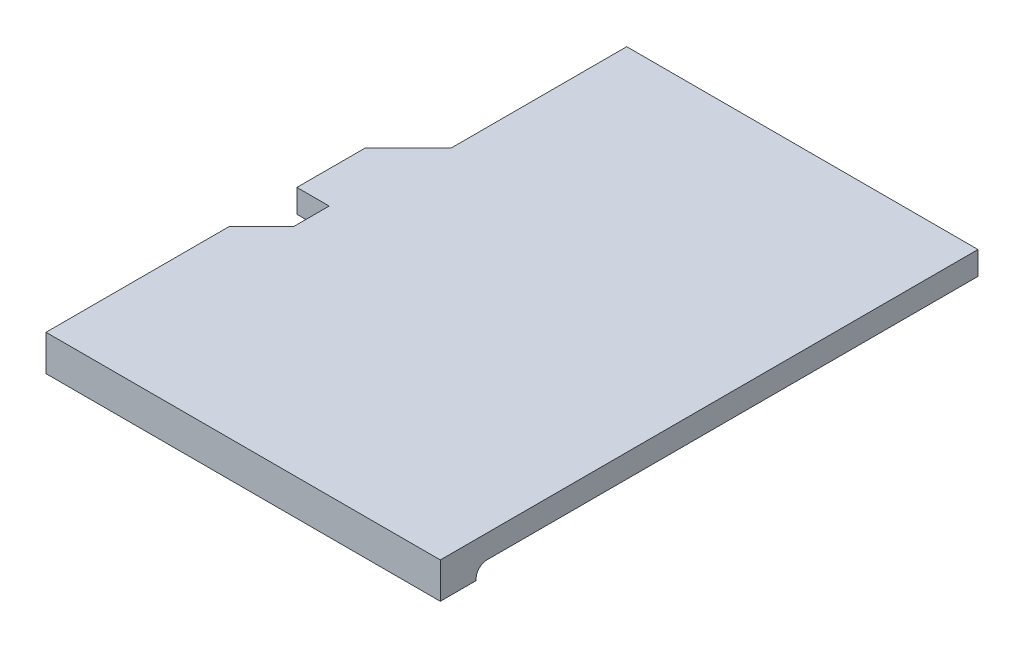
ISO-10303-21;
HEADER;
FILE_DESCRIPTION(('STEP AP214'),'2;1');
FILE_NAME('part.step','',(''),(''),'','','');
FILE_SCHEMA(('AUTOMOTIVE_DESIGN { 1 0 10303 214 1 1 1 1 }'));
ENDSEC;
DATA;
#1=APPLICATION_CONTEXT('core data for automotive mechanical design processes');
#2=APPLICATION_PROTOCOL_DEFINITION('international standard','automotive_design',2000,#1);
#3=PRODUCT_CONTEXT('',#1,'mechanical');
#4=PRODUCT('Part','Part','',(#3));
#5=PRODUCT_RELATED_PRODUCT_CATEGORY('part','',(#4));
#6=PRODUCT_DEFINITION_FORMATION('','',#4);
#7=PRODUCT_DEFINITION_CONTEXT('part definition',#1,'design');
#8=PRODUCT_DEFINITION('design','',#6,#7);
#9=PRODUCT_DEFINITION_SHAPE('','',#8);
#10=(LENGTH_UNIT() NAMED_UNIT(*) SI_UNIT(.MILLI.,.METRE.));
#11=(NAMED_UNIT(*) PLANE_ANGLE_UNIT() SI_UNIT($,.RADIAN.));
#12=(NAMED_UNIT(*) SI_UNIT($,.STERADIAN.) SOLID_ANGLE_UNIT());
#13=UNCERTAINTY_MEASURE_WITH_UNIT(LENGTH_MEASURE(1.E-05),#10,'distance_accuracy_value','');
#14=(GEOMETRIC_REPRESENTATION_CONTEXT(3) GLOBAL_UNCERTAINTY_ASSIGNED_CONTEXT((#13)) GLOBAL_UNIT_ASSIGNED_CONTEXT((#10,
#11,#12)) REPRESENTATION_CONTEXT('',''));
#15=CARTESIAN_POINT('',(0.,0.,0.));
#16=DIRECTION('',(0.,0.,1.));
#17=DIRECTION('',(1.,0.,0.));
#18=AXIS2_PLACEMENT_3D('',#15,#16,#17);
#19=CARTESIAN_POINT('',(0.,0.,36.5));
#20=DIRECTION('',(0.,-1.,0.));
#21=DIRECTION('',(0.,0.,-1.));
#22=AXIS2_PLACEMENT_3D('',#19,#20,#21);
#23=CYLINDRICAL_SURFACE('',#22,30.5);
#24=CARTESIAN_POINT('',(0.,-0.35,36.5));
#25=DIRECTION('',(0.,-1.,0.));
#26=DIRECTION('',(0.,0.,-1.));
#27=AXIS2_PLACEMENT_3D('',#24,#25,#26);
#28=CIRCLE('',#27,30.5);
#29=CARTESIAN_POINT('',(-5.5,-0.35,6.5));
#30=VERTEX_POINT('',#29);
#31=CARTESIAN_POINT('',(5.5,-0.35,6.5));
#32=VERTEX_POINT('',#31);
#33=EDGE_CURVE('E131',#30,#32,#28,.T.);
#34=ORIENTED_EDGE('',*,*,#33,.F.);
#35=DIRECTION('',(0.,-1.,0.));
#36=VECTOR('',#35,1.);
#37=CARTESIAN_POINT('',(-5.5,0.,6.5));
#38=LINE('',#37,#36);
#39=CARTESIAN_POINT('',(-5.5,-0.3,6.5));
#40=VERTEX_POINT('',#39);
#41=EDGE_CURVE('E120',#30,#40,#38,.F.);
#42=ORIENTED_EDGE('',*,*,#41,.T.);
#43=CARTESIAN_POINT('',(0.,-0.3,36.5));
#44=DIRECTION('',(0.,1.,0.));
#45=DIRECTION('',(0.,0.,1.));
#46=AXIS2_PLACEMENT_3D('',#43,#44,#45);
#47=CIRCLE('',#46,30.5);
#48=CARTESIAN_POINT('',(5.5,-0.3,6.5));
#49=VERTEX_POINT('',#48);
#50=EDGE_CURVE('E127',#40,#49,#47,.F.);
#51=ORIENTED_EDGE('',*,*,#50,.T.);
#52=DIRECTION('',(0.,-1.,0.));
#53=VECTOR('',#52,1.);
#54=CARTESIAN_POINT('',(5.5,0.,6.5));
#55=LINE('',#54,#53);
#56=EDGE_CURVE('E112',#49,#32,#55,.T.);
#57=ORIENTED_EDGE('',*,*,#56,.T.);
#58=EDGE_LOOP('',(#34,#42,#51,#57));
#59=FACE_BOUND('',#58,.T.);
#60=ADVANCED_FACE('F16',(#59),#23,.T.);
#61=CARTESIAN_POINT('',(0.,-0.3,36.5));
#62=DIRECTION('',(0.,1.,0.));
#63=DIRECTION('',(0.,0.,1.));
#64=AXIS2_PLACEMENT_3D('',#61,#62,#63);
#65=TOROIDAL_SURFACE('',#64,30.8,0.3);
#66=ORIENTED_EDGE('',*,*,#50,.F.);
#67=CARTESIAN_POINT('',(-5.50000000000001,0.,6.19504990929699));
#68=CARTESIAN_POINT('',(-5.4999999999995,1.33591663660623E-05,6.21241243459702));
#69=CARTESIAN_POINT('',(-5.49999999999971,-0.0014584749207835,6.22977221391287));
#70=CARTESIAN_POINT('',(-5.50000000000029,-0.00727537093845433,6.26399834473381));
#71=CARTESIAN_POINT('',(-5.50000000000067,-0.0116195360169997,6.28086484854246));
#72=CARTESIAN_POINT('',(-5.50000000000038,-0.0230876845066284,6.3136383261426));
#73=CARTESIAN_POINT('',(-5.49999999999971,-0.0302134299476715,6.32954468432763));
#74=CARTESIAN_POINT('',(-5.50000000000029,-0.0470507940960762,6.3599190939301));
#75=CARTESIAN_POINT('',(-5.50000000000156,-0.0567616194024566,6.3743875847833));
#76=CARTESIAN_POINT('',(-5.50000000000162,-0.0784294057998209,6.40136040939991));
#77=CARTESIAN_POINT('',(-5.50000000000043,-0.0903696361954534,6.41387817559003));
#78=CARTESIAN_POINT('',(-5.49999999999957,-0.116211132024598,6.43669167210008));
#79=CARTESIAN_POINT('',(-5.49999999999989,-0.130112084961435,6.4469877558478));
#80=CARTESIAN_POINT('',(-5.50000000000011,-0.159253136893758,6.46489826908499));
#81=CARTESIAN_POINT('',(-5.50000000000003,-0.174469702927348,6.47255103554552));
#82=CARTESIAN_POINT('',(-5.49999999999997,-0.205980556919425,6.48514460204624));
#83=CARTESIAN_POINT('',(-5.49999999999999,-0.222273944317642,6.49008763690061));
#84=CARTESIAN_POINT('',(-5.5,-0.248909603235763,6.49572631466867));
#85=CARTESIAN_POINT('',(-5.5,-0.259068674145335,6.49732802223716));
#86=CARTESIAN_POINT('',(-5.5,-0.279483578737172,6.49946458489195));
#87=CARTESIAN_POINT('',(-5.5,-0.289739252276583,6.50000097072089));
#88=CARTESIAN_POINT('',(-5.5,-0.299999999999996,6.49999999999999));
#89=B_SPLINE_CURVE_WITH_KNOTS('',3,(#67,#68,#69,#70,#71,#72,#73,#74,#75,#76,#77,#78,#79,#80,#81,
#82,#83,#84,#85,#86,#87,#88),.UNSPECIFIED.,.F.,.F.,(4,2,2,2,2,2,2,2,2,2,4),(0.,
0.0520216922137032,0.104027148924245,0.156065602799885,0.208088103646524,0.259734841042164,
0.311373356348775,0.362227955165807,0.413040549003677,0.443843165959415,0.474601491046942),.UNSPECIFIED.);
#90=CARTESIAN_POINT('',(-5.49999999999999,0.,6.19504990929699));
#91=VERTEX_POINT('',#90);
#92=EDGE_CURVE('E117',#91,#40,#89,.T.);
#93=ORIENTED_EDGE('',*,*,#92,.F.);
#94=CARTESIAN_POINT('',(0.,0.,36.5));
#95=DIRECTION('',(0.,-1.,0.));
#96=DIRECTION('',(-0.178571428571428,0.,-0.983926950996851));
#97=AXIS2_PLACEMENT_3D('',#94,#95,#96);
#98=CIRCLE('',#97,30.8);
#99=CARTESIAN_POINT('',(5.5,0.,6.19504990929699));
#100=VERTEX_POINT('',#99);
#101=EDGE_CURVE('E144',#91,#100,#98,.T.);
#102=ORIENTED_EDGE('',*,*,#101,.T.);
#103=CARTESIAN_POINT('',(5.50000000000001,-0.3,6.49999999999999));
#104=CARTESIAN_POINT('',(5.49999999999996,-0.283322027292299,6.50001549346963));
#105=CARTESIAN_POINT('',(5.49999999999998,-0.266649991355988,6.49858702026892));
#106=CARTESIAN_POINT('',(5.50000000000002,-0.233801123224783,6.49295845943377));
#107=CARTESIAN_POINT('',(5.50000000000004,-0.217623696857119,6.48876184600417));
#108=CARTESIAN_POINT('',(5.49999999999995,-0.186198271619582,6.47771103302166));
#109=CARTESIAN_POINT('',(5.49999999999985,-0.170950570559622,6.4708559870403));
#110=CARTESIAN_POINT('',(5.50000000000015,-0.141812070083496,6.45470279694147));
#111=CARTESIAN_POINT('',(5.50000000000056,-0.127921211183974,6.44540475998963));
#112=CARTESIAN_POINT('',(5.50000000000052,-0.10177481322185,6.42456445317543));
#113=CARTESIAN_POINT('',(5.50000000000006,-0.0895318508629306,6.41300641226746));
#114=CARTESIAN_POINT('',(5.49999999999994,-0.0671233254217876,6.38802611476666));
#115=CARTESIAN_POINT('',(5.50000000000026,-0.0569579996828737,6.37460364548067));
#116=CARTESIAN_POINT('',(5.50000000000032,-0.0388245508854178,6.34605271408475));
#117=CARTESIAN_POINT('',(5.50000000000005,-0.0308934194654258,6.33090078154519));
#118=CARTESIAN_POINT('',(5.49999999999995,-0.0176486358557576,6.29949574661209));
#119=CARTESIAN_POINT('',(5.50000000000013,-0.0123340403630538,6.28324304347133));
#120=CARTESIAN_POINT('',(5.50000000000014,-0.00560463269504238,6.25494252531882));
#121=CARTESIAN_POINT('',(5.50000000000006,-0.00350419527526133,6.24305286728713));
#122=CARTESIAN_POINT('',(5.49999999999994,-0.000701922432728202,6.21912686292336));
#123=CARTESIAN_POINT('',(5.4999999999999,1.87853952070261E-06,6.20709074676156));
#124=CARTESIAN_POINT('',(5.49999999999999,0.,6.195049909297));
#125=B_SPLINE_CURVE_WITH_KNOTS('',3,(#103,#104,#105,#106,#107,#108,#109,#110,#111,#112,#113,
#114,#115,#116,#117,#118,#119,#120,#121,#122,#123,#124),.UNSPECIFIED.,.F.,.F.,(4,2,2,2,2,2,2,2,
2,2,4),(0.,0.0499640333725207,0.0998654774881927,0.149782822976273,0.199697979127064,
0.24997476188535,0.300257284914306,0.351329041840026,0.40238237307373,0.438526066866833,
0.474618857831877),.UNSPECIFIED.);
#126=EDGE_CURVE('E135',#49,#100,#125,.T.);
#127=ORIENTED_EDGE('',*,*,#126,.F.);
#128=EDGE_LOOP('',(#66,#93,#102,#127));
#129=FACE_BOUND('',#128,.T.);
#130=ADVANCED_FACE('F134',(#129),#65,.F.);
#131=CARTESIAN_POINT('',(0.,-0.35,6.93372741582503));
#132=DIRECTION('',(0.,-1.,0.));
#133=DIRECTION('',(0.,0.,-1.));
#134=AXIS2_PLACEMENT_3D('',#131,#132,#133);
#135=PLANE('',#134);
#136=DIRECTION('',(0.,0.,-1.));
#137=VECTOR('',#136,1.);
#138=CARTESIAN_POINT('',(5.5,-0.35,6.93372741582503));
#139=LINE('',#138,#137);
#140=CARTESIAN_POINT('',(5.5,-0.35,7.5));
#141=VERTEX_POINT('',#140);
#142=EDGE_CURVE('E270',#32,#141,#139,.F.);
#143=ORIENTED_EDGE('',*,*,#142,.T.);
#144=DIRECTION('',(1.,0.,0.));
#145=VECTOR('',#144,1.);
#146=CARTESIAN_POINT('',(-5.5,-0.35,7.5));
#147=LINE('',#146,#145);
#148=CARTESIAN_POINT('',(-5.5,-0.35,7.5));
#149=VERTEX_POINT('',#148);
#150=EDGE_CURVE('E149',#149,#141,#147,.T.);
#151=ORIENTED_EDGE('',*,*,#150,.F.);
#152=DIRECTION('',(0.,0.,-1.));
#153=VECTOR('',#152,1.);
#154=CARTESIAN_POINT('',(-5.5,-0.35,6.93372741582503));
#155=LINE('',#154,#153);
#156=EDGE_CURVE('E137',#149,#30,#155,.T.);
#157=ORIENTED_EDGE('',*,*,#156,.T.);
#158=ORIENTED_EDGE('',*,*,#33,.T.);
#159=EDGE_LOOP('',(#143,#151,#157,#158));
#160=FACE_BOUND('',#159,.T.);
#161=ADVANCED_FACE('F159',(#160),#135,.T.);
#162=CARTESIAN_POINT('',(0.0936244587815548,0.,0.17467868973583));
#163=DIRECTION('',(0.,1.,0.));
#164=DIRECTION('',(0.,0.,1.));
#165=AXIS2_PLACEMENT_3D('',#162,#163,#164);
#166=PLANE('',#165);
#167=DIRECTION('',(0.,0.,1.));
#168=VECTOR('',#167,1.);
#169=CARTESIAN_POINT('',(-5.5,0.,2.4));
#170=LINE('',#169,#168);
#171=CARTESIAN_POINT('',(-5.5,0.,2.4));
#172=VERTEX_POINT('',#171);
#173=EDGE_CURVE('E122',#172,#91,#170,.T.);
#174=ORIENTED_EDGE('',*,*,#173,.F.);
#175=DIRECTION('',(-0.707106781186547,0.,0.707106781186548));
#176=VECTOR('',#175,1.);
#177=CARTESIAN_POINT('',(-4.6,0.,1.5));
#178=LINE('',#177,#176);
#179=CARTESIAN_POINT('',(-4.6,0.,1.5));
#180=VERTEX_POINT('',#179);
#181=EDGE_CURVE('E190',#180,#172,#178,.T.);
#182=ORIENTED_EDGE('',*,*,#181,.F.);
#183=DIRECTION('',(0.,0.,1.));
#184=VECTOR('',#183,1.);
#185=CARTESIAN_POINT('',(-4.6,0.,0.5));
#186=LINE('',#185,#184);
#187=CARTESIAN_POINT('',(-4.6,0.,0.499999999999999));
#188=VERTEX_POINT('',#187);
#189=EDGE_CURVE('E206',#188,#180,#186,.T.);
#190=ORIENTED_EDGE('',*,*,#189,.F.);
#191=DIRECTION('',(1.,0.,0.));
#192=VECTOR('',#191,1.);
#193=CARTESIAN_POINT('',(-5.5,0.,0.5));
#194=LINE('',#193,#192);
#195=CARTESIAN_POINT('',(-5.5,0.,0.5));
#196=VERTEX_POINT('',#195);
#197=EDGE_CURVE('E216',#196,#188,#194,.T.);
#198=ORIENTED_EDGE('',*,*,#197,.F.);
#199=DIRECTION('',(0.,0.,1.));
#200=VECTOR('',#199,1.);
#201=CARTESIAN_POINT('',(-5.5,0.,-1.4));
#202=LINE('',#201,#200);
#203=CARTESIAN_POINT('',(-5.5,0.,-1.4));
#204=VERTEX_POINT('',#203);
#205=EDGE_CURVE('E226',#204,#196,#202,.T.);
#206=ORIENTED_EDGE('',*,*,#205,.F.);
#207=DIRECTION('',(-0.707106781186548,0.,0.707106781186547));
#208=VECTOR('',#207,1.);
#209=CARTESIAN_POINT('',(-4.3,0.,-2.6));
#210=LINE('',#209,#208);
#211=CARTESIAN_POINT('',(-4.3,0.,-2.6));
#212=VERTEX_POINT('',#211);
#213=EDGE_CURVE('E236',#212,#204,#210,.T.);
#214=ORIENTED_EDGE('',*,*,#213,.F.);
#215=DIRECTION('',(0.,0.,1.));
#216=VECTOR('',#215,1.);
#217=CARTESIAN_POINT('',(-4.3,0.,-7.5));
#218=LINE('',#217,#216);
#219=CARTESIAN_POINT('',(-4.3,0.,-7.5));
#220=VERTEX_POINT('',#219);
#221=EDGE_CURVE('E246',#220,#212,#218,.T.);
#222=ORIENTED_EDGE('',*,*,#221,.F.);
#223=DIRECTION('',(-1.,0.,0.));
#224=VECTOR('',#223,1.);
#225=CARTESIAN_POINT('',(5.5,0.,-7.5));
#226=LINE('',#225,#224);
#227=CARTESIAN_POINT('',(5.5,0.,-7.5));
#228=VERTEX_POINT('',#227);
#229=EDGE_CURVE('E256',#228,#220,#226,.T.);
#230=ORIENTED_EDGE('',*,*,#229,.F.);
#231=DIRECTION('',(0.,0.,-1.));
#232=VECTOR('',#231,1.);
#233=CARTESIAN_POINT('',(5.5,0.,7.5));
#234=LINE('',#233,#232);
#235=EDGE_CURVE('E286',#100,#228,#234,.T.);
#236=ORIENTED_EDGE('',*,*,#235,.F.);
#237=ORIENTED_EDGE('',*,*,#101,.F.);
#238=EDGE_LOOP('',(#174,#182,#190,#198,#206,#214,#222,#230,#236,#237));
#239=FACE_BOUND('',#238,.T.);
#240=ADVANCED_FACE('F179',(#239),#166,.F.);
#241=CARTESIAN_POINT('',(-5.5,0.,7.5));
#242=DIRECTION('',(0.,0.,1.));
#243=DIRECTION('',(1.,0.,0.));
#244=AXIS2_PLACEMENT_3D('',#241,#242,#243);
#245=PLANE('',#244);
#246=DIRECTION('',(0.,1.,0.));
#247=VECTOR('',#246,1.);
#248=CARTESIAN_POINT('',(-5.5,0.,7.5));
#249=LINE('',#248,#247);
#250=CARTESIAN_POINT('',(-5.5,0.65,7.5));
#251=VERTEX_POINT('',#250);
#252=EDGE_CURVE('E203',#149,#251,#249,.T.);
#253=ORIENTED_EDGE('',*,*,#252,.F.);
#254=ORIENTED_EDGE('',*,*,#150,.T.);
#255=DIRECTION('',(0.,1.,0.));
#256=VECTOR('',#255,1.);
#257=CARTESIAN_POINT('',(5.5,0.,7.5));
#258=LINE('',#257,#256);
#259=CARTESIAN_POINT('',(5.5,0.65,7.5));
#260=VERTEX_POINT('',#259);
#261=EDGE_CURVE('E259',#260,#141,#258,.F.);
#262=ORIENTED_EDGE('',*,*,#261,.F.);
#263=DIRECTION('',(1.,0.,0.));
#264=VECTOR('',#263,1.);
#265=CARTESIAN_POINT('',(0.0936244587815549,0.65,7.5));
#266=LINE('',#265,#264);
#267=EDGE_CURVE('E202',#251,#260,#266,.T.);
#268=ORIENTED_EDGE('',*,*,#267,.F.);
#269=EDGE_LOOP('',(#253,#254,#262,#268));
#270=FACE_BOUND('',#269,.T.);
#271=ADVANCED_FACE('F176',(#270),#245,.T.);
#272=CARTESIAN_POINT('',(5.5,0.,7.5));
#273=DIRECTION('',(1.,0.,0.));
#274=DIRECTION('',(0.,0.,-1.));
#275=AXIS2_PLACEMENT_3D('',#272,#273,#274);
#276=PLANE('',#275);
#277=ORIENTED_EDGE('',*,*,#56,.F.);
#278=ORIENTED_EDGE('',*,*,#126,.T.);
#279=ORIENTED_EDGE('',*,*,#235,.T.);
#280=DIRECTION('',(0.,1.,0.));
#281=VECTOR('',#280,1.);
#282=CARTESIAN_POINT('',(5.5,0.,-7.5));
#283=LINE('',#282,#281);
#284=CARTESIAN_POINT('',(5.5,0.65,-7.5));
#285=VERTEX_POINT('',#284);
#286=EDGE_CURVE('E249',#285,#228,#283,.F.);
#287=ORIENTED_EDGE('',*,*,#286,.F.);
#288=DIRECTION('',(0.,0.,1.));
#289=VECTOR('',#288,1.);
#290=CARTESIAN_POINT('',(5.5,0.65,0.17467868973583));
#291=LINE('',#290,#289);
#292=EDGE_CURVE('E299',#260,#285,#291,.F.);
#293=ORIENTED_EDGE('',*,*,#292,.F.);
#294=ORIENTED_EDGE('',*,*,#261,.T.);
#295=ORIENTED_EDGE('',*,*,#142,.F.);
#296=EDGE_LOOP('',(#277,#278,#279,#287,#293,#294,#295));
#297=FACE_BOUND('',#296,.T.);
#298=ADVANCED_FACE('F170',(#297),#276,.T.);
#299=CARTESIAN_POINT('',(5.5,0.,-7.5));
#300=DIRECTION('',(0.,0.,-1.));
#301=DIRECTION('',(-1.,0.,0.));
#302=AXIS2_PLACEMENT_3D('',#299,#300,#301);
#303=PLANE('',#302);
#304=DIRECTION('',(1.,0.,0.));
#305=VECTOR('',#304,1.);
#306=CARTESIAN_POINT('',(0.0936244587815549,0.65,-7.5));
#307=LINE('',#306,#305);
#308=CARTESIAN_POINT('',(-4.3,0.65,-7.5));
#309=VERTEX_POINT('',#308);
#310=EDGE_CURVE('E302',#285,#309,#307,.F.);
#311=ORIENTED_EDGE('',*,*,#310,.F.);
#312=ORIENTED_EDGE('',*,*,#286,.T.);
#313=ORIENTED_EDGE('',*,*,#229,.T.);
#314=DIRECTION('',(0.,1.,0.));
#315=VECTOR('',#314,1.);
#316=CARTESIAN_POINT('',(-4.3,0.,-7.5));
#317=LINE('',#316,#315);
#318=EDGE_CURVE('E239',#309,#220,#317,.F.);
#319=ORIENTED_EDGE('',*,*,#318,.F.);
#320=EDGE_LOOP('',(#311,#312,#313,#319));
#321=FACE_BOUND('',#320,.T.);
#322=ADVANCED_FACE('F175',(#321),#303,.T.);
#323=CARTESIAN_POINT('',(-4.3,0.,-7.5));
#324=DIRECTION('',(-1.,0.,0.));
#325=DIRECTION('',(0.,0.,1.));
#326=AXIS2_PLACEMENT_3D('',#323,#324,#325);
#327=PLANE('',#326);
#328=DIRECTION('',(0.,0.,1.));
#329=VECTOR('',#328,1.);
#330=CARTESIAN_POINT('',(-4.3,0.65,0.17467868973583));
#331=LINE('',#330,#329);
#332=CARTESIAN_POINT('',(-4.3,0.65,-2.6));
#333=VERTEX_POINT('',#332);
#334=EDGE_CURVE('E305',#309,#333,#331,.T.);
#335=ORIENTED_EDGE('',*,*,#334,.F.);
#336=ORIENTED_EDGE('',*,*,#318,.T.);
#337=ORIENTED_EDGE('',*,*,#221,.T.);
#338=DIRECTION('',(0.,1.,0.));
#339=VECTOR('',#338,1.);
#340=CARTESIAN_POINT('',(-4.3,0.,-2.6));
#341=LINE('',#340,#339);
#342=EDGE_CURVE('E229',#333,#212,#341,.F.);
#343=ORIENTED_EDGE('',*,*,#342,.F.);
#344=EDGE_LOOP('',(#335,#336,#337,#343));
#345=FACE_BOUND('',#344,.T.);
#346=ADVANCED_FACE('F338',(#345),#327,.T.);
#347=CARTESIAN_POINT('',(-4.3,0.,-2.6));
#348=DIRECTION('',(-0.707106781186547,0.,-0.707106781186548));
#349=DIRECTION('',(-0.707106781186548,0.,0.707106781186547));
#350=AXIS2_PLACEMENT_3D('',#347,#348,#349);
#351=PLANE('',#350);
#352=DIRECTION('',(-0.707106781186547,0.,0.707106781186548));
#353=VECTOR('',#352,1.);
#354=CARTESIAN_POINT('',(-4.3,0.65,-2.6));
#355=LINE('',#354,#353);
#356=CARTESIAN_POINT('',(-5.5,0.65,-1.4));
#357=VERTEX_POINT('',#356);
#358=EDGE_CURVE('E308',#333,#357,#355,.T.);
#359=ORIENTED_EDGE('',*,*,#358,.F.);
#360=ORIENTED_EDGE('',*,*,#342,.T.);
#361=ORIENTED_EDGE('',*,*,#213,.T.);
#362=DIRECTION('',(0.,1.,0.));
#363=VECTOR('',#362,1.);
#364=CARTESIAN_POINT('',(-5.5,0.,-1.4));
#365=LINE('',#364,#363);
#366=EDGE_CURVE('E219',#357,#204,#365,.F.);
#367=ORIENTED_EDGE('',*,*,#366,.F.);
#368=EDGE_LOOP('',(#359,#360,#361,#367));
#369=FACE_BOUND('',#368,.T.);
#370=ADVANCED_FACE('F335',(#369),#351,.T.);
#371=CARTESIAN_POINT('',(-5.5,0.,-1.4));
#372=DIRECTION('',(-1.,0.,0.));
#373=DIRECTION('',(0.,0.,1.));
#374=AXIS2_PLACEMENT_3D('',#371,#372,#373);
#375=PLANE('',#374);
#376=DIRECTION('',(0.,0.,1.));
#377=VECTOR('',#376,1.);
#378=CARTESIAN_POINT('',(-5.5,0.65,0.17467868973583));
#379=LINE('',#378,#377);
#380=CARTESIAN_POINT('',(-5.5,0.65,0.5));
#381=VERTEX_POINT('',#380);
#382=EDGE_CURVE('E311',#357,#381,#379,.T.);
#383=ORIENTED_EDGE('',*,*,#382,.F.);
#384=ORIENTED_EDGE('',*,*,#366,.T.);
#385=ORIENTED_EDGE('',*,*,#205,.T.);
#386=DIRECTION('',(0.,1.,0.));
#387=VECTOR('',#386,1.);
#388=CARTESIAN_POINT('',(-5.5,0.,0.5));
#389=LINE('',#388,#387);
#390=EDGE_CURVE('E209',#381,#196,#389,.F.);
#391=ORIENTED_EDGE('',*,*,#390,.F.);
#392=EDGE_LOOP('',(#383,#384,#385,#391));
#393=FACE_BOUND('',#392,.T.);
#394=ADVANCED_FACE('F332',(#393),#375,.T.);
#395=CARTESIAN_POINT('',(-5.5,0.,0.5));
#396=DIRECTION('',(0.,0.,1.));
#397=DIRECTION('',(1.,0.,0.));
#398=AXIS2_PLACEMENT_3D('',#395,#396,#397);
#399=PLANE('',#398);
#400=DIRECTION('',(1.,0.,0.));
#401=VECTOR('',#400,1.);
#402=CARTESIAN_POINT('',(0.0936244587815549,0.65,0.499999999999999));
#403=LINE('',#402,#401);
#404=CARTESIAN_POINT('',(-4.6,0.65,0.5));
#405=VERTEX_POINT('',#404);
#406=EDGE_CURVE('E314',#381,#405,#403,.T.);
#407=ORIENTED_EDGE('',*,*,#406,.F.);
#408=ORIENTED_EDGE('',*,*,#390,.T.);
#409=ORIENTED_EDGE('',*,*,#197,.T.);
#410=DIRECTION('',(0.,1.,0.));
#411=VECTOR('',#410,1.);
#412=CARTESIAN_POINT('',(-4.6,0.,0.499999999999999));
#413=LINE('',#412,#411);
#414=EDGE_CURVE('E198',#405,#188,#413,.F.);
#415=ORIENTED_EDGE('',*,*,#414,.F.);
#416=EDGE_LOOP('',(#407,#408,#409,#415));
#417=FACE_BOUND('',#416,.T.);
#418=ADVANCED_FACE('F329',(#417),#399,.T.);
#419=CARTESIAN_POINT('',(-4.6,0.,0.5));
#420=DIRECTION('',(-1.,0.,0.));
#421=DIRECTION('',(0.,0.,1.));
#422=AXIS2_PLACEMENT_3D('',#419,#420,#421);
#423=PLANE('',#422);
#424=DIRECTION('',(0.,0.,1.));
#425=VECTOR('',#424,1.);
#426=CARTESIAN_POINT('',(-4.6,0.65,0.17467868973583));
#427=LINE('',#426,#425);
#428=CARTESIAN_POINT('',(-4.6,0.65,1.5));
#429=VERTEX_POINT('',#428);
#430=EDGE_CURVE('E317',#405,#429,#427,.T.);
#431=ORIENTED_EDGE('',*,*,#430,.F.);
#432=ORIENTED_EDGE('',*,*,#414,.T.);
#433=ORIENTED_EDGE('',*,*,#189,.T.);
#434=DIRECTION('',(0.,1.,0.));
#435=VECTOR('',#434,1.);
#436=CARTESIAN_POINT('',(-4.6,0.,1.5));
#437=LINE('',#436,#435);
#438=EDGE_CURVE('E197',#429,#180,#437,.F.);
#439=ORIENTED_EDGE('',*,*,#438,.F.);
#440=EDGE_LOOP('',(#431,#432,#433,#439));
#441=FACE_BOUND('',#440,.T.);
#442=ADVANCED_FACE('F326',(#441),#423,.T.);
#443=CARTESIAN_POINT('',(-4.6,0.,1.5));
#444=DIRECTION('',(-0.707106781186548,0.,-0.707106781186547));
#445=DIRECTION('',(-0.707106781186547,0.,0.707106781186548));
#446=AXIS2_PLACEMENT_3D('',#443,#444,#445);
#447=PLANE('',#446);
#448=DIRECTION('',(-0.707106781186548,0.,0.707106781186548));
#449=VECTOR('',#448,1.);
#450=CARTESIAN_POINT('',(-4.6,0.65,1.5));
#451=LINE('',#450,#449);
#452=CARTESIAN_POINT('',(-5.5,0.65,2.4));
#453=VERTEX_POINT('',#452);
#454=EDGE_CURVE('E29',#429,#453,#451,.T.);
#455=ORIENTED_EDGE('',*,*,#454,.F.);
#456=ORIENTED_EDGE('',*,*,#438,.T.);
#457=ORIENTED_EDGE('',*,*,#181,.T.);
#458=DIRECTION('',(0.,1.,0.));
#459=VECTOR('',#458,1.);
#460=CARTESIAN_POINT('',(-5.5,0.,2.4));
#461=LINE('',#460,#459);
#462=EDGE_CURVE('E38',#453,#172,#461,.F.);
#463=ORIENTED_EDGE('',*,*,#462,.F.);
#464=EDGE_LOOP('',(#455,#456,#457,#463));
#465=FACE_BOUND('',#464,.T.);
#466=ADVANCED_FACE('F324',(#465),#447,.T.);
#467=CARTESIAN_POINT('',(-5.5,0.,2.4));
#468=DIRECTION('',(-1.,0.,0.));
#469=DIRECTION('',(0.,0.,1.));
#470=AXIS2_PLACEMENT_3D('',#467,#468,#469);
#471=PLANE('',#470);
#472=DIRECTION('',(0.,0.,1.));
#473=VECTOR('',#472,1.);
#474=CARTESIAN_POINT('',(-5.5,0.65,0.17467868973583));
#475=LINE('',#474,#473);
#476=EDGE_CURVE('E10',#453,#251,#475,.T.);
#477=ORIENTED_EDGE('',*,*,#476,.F.);
#478=ORIENTED_EDGE('',*,*,#462,.T.);
#479=ORIENTED_EDGE('',*,*,#173,.T.);
#480=ORIENTED_EDGE('',*,*,#92,.T.);
#481=ORIENTED_EDGE('',*,*,#41,.F.);
#482=ORIENTED_EDGE('',*,*,#156,.F.);
#483=ORIENTED_EDGE('',*,*,#252,.T.);
#484=EDGE_LOOP('',(#477,#478,#479,#480,#481,#482,#483));
#485=FACE_BOUND('',#484,.T.);
#486=ADVANCED_FACE('F119',(#485),#471,.T.);
#487=CARTESIAN_POINT('',(0.0936244587815549,0.65,0.17467868973583));
#488=DIRECTION('',(0.,1.,0.));
#489=DIRECTION('',(0.,0.,1.));
#490=AXIS2_PLACEMENT_3D('',#487,#488,#489);
#491=PLANE('',#490);
#492=ORIENTED_EDGE('',*,*,#454,.T.);
#493=ORIENTED_EDGE('',*,*,#476,.T.);
#494=ORIENTED_EDGE('',*,*,#267,.T.);
#495=ORIENTED_EDGE('',*,*,#292,.T.);
#496=ORIENTED_EDGE('',*,*,#310,.T.);
#497=ORIENTED_EDGE('',*,*,#334,.T.);
#498=ORIENTED_EDGE('',*,*,#358,.T.);
#499=ORIENTED_EDGE('',*,*,#382,.T.);
#500=ORIENTED_EDGE('',*,*,#406,.T.);
#501=ORIENTED_EDGE('',*,*,#430,.T.);
#502=EDGE_LOOP('',(#492,#493,#494,#495,#496,#497,#498,#499,#500,#501));
#503=FACE_BOUND('',#502,.T.);
#504=ADVANCED_FACE('F322',(#503),#491,.T.);
#505=CLOSED_SHELL('',(#60,#130,#161,#240,#271,#298,#322,#346,#370,#394,#418,#442,#466,#486,#504));
#506=MANIFOLD_SOLID_BREP('B1',#505);
#507=ADVANCED_BREP_SHAPE_REPRESENTATION('',(#18,#506),#14);
#508=SHAPE_DEFINITION_REPRESENTATION(#9,#507);
ENDSEC;
END-ISO-10303-21;
